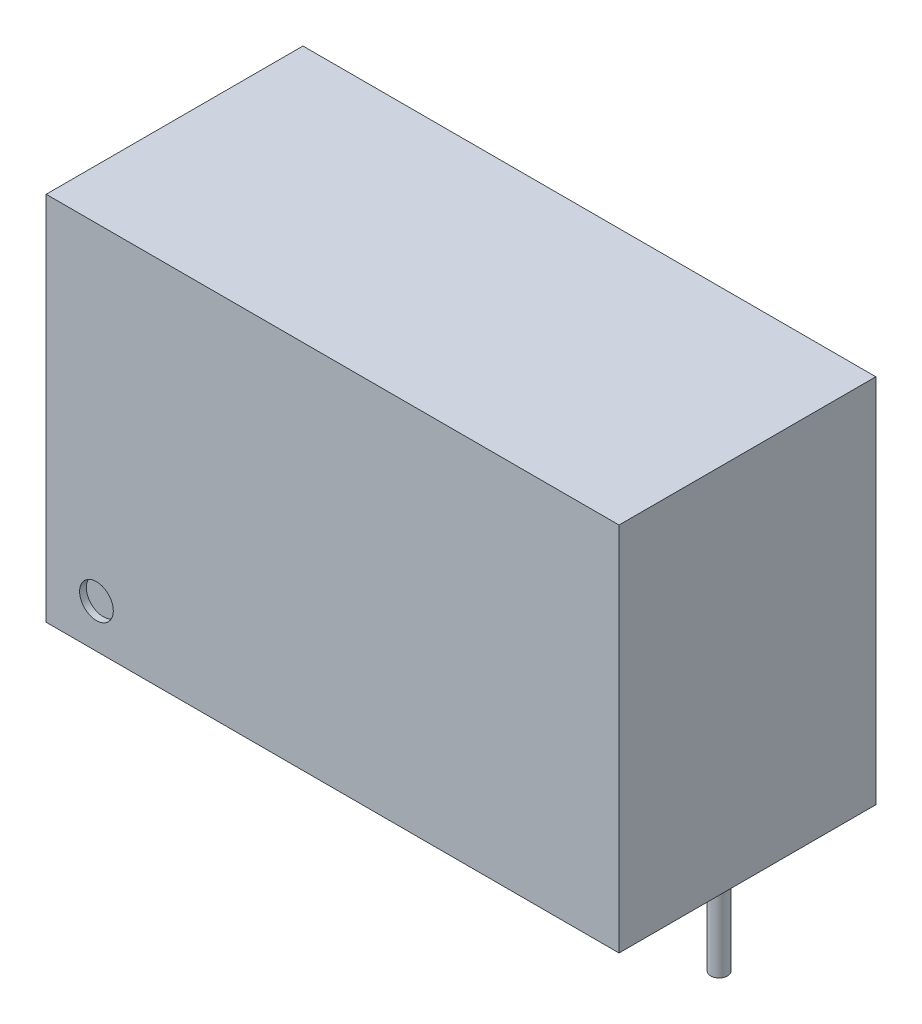
ISO-10303-21;
HEADER;
FILE_DESCRIPTION(('STEP AP214'),'2;1');
FILE_NAME('part.step','',(''),(''),'','','');
FILE_SCHEMA(('AUTOMOTIVE_DESIGN { 1 0 10303 214 1 1 1 1 }'));
ENDSEC;
DATA;
#1=APPLICATION_CONTEXT('core data for automotive mechanical design processes');
#2=APPLICATION_PROTOCOL_DEFINITION('international standard','automotive_design',2000,#1);
#3=PRODUCT_CONTEXT('',#1,'mechanical');
#4=PRODUCT('Part','Part','',(#3));
#5=PRODUCT_RELATED_PRODUCT_CATEGORY('part','',(#4));
#6=PRODUCT_DEFINITION_FORMATION('','',#4);
#7=PRODUCT_DEFINITION_CONTEXT('part definition',#1,'design');
#8=PRODUCT_DEFINITION('design','',#6,#7);
#9=PRODUCT_DEFINITION_SHAPE('','',#8);
#10=(LENGTH_UNIT() NAMED_UNIT(*) SI_UNIT(.MILLI.,.METRE.));
#11=(NAMED_UNIT(*) PLANE_ANGLE_UNIT() SI_UNIT($,.RADIAN.));
#12=(NAMED_UNIT(*) SI_UNIT($,.STERADIAN.) SOLID_ANGLE_UNIT());
#13=UNCERTAINTY_MEASURE_WITH_UNIT(LENGTH_MEASURE(1.E-05),#10,'distance_accuracy_value','');
#14=(GEOMETRIC_REPRESENTATION_CONTEXT(3) GLOBAL_UNCERTAINTY_ASSIGNED_CONTEXT((#13)) GLOBAL_UNIT_ASSIGNED_CONTEXT((#10,
#11,#12)) REPRESENTATION_CONTEXT('',''));
#15=CARTESIAN_POINT('',(0.,0.,0.));
#16=DIRECTION('',(0.,0.,1.));
#17=DIRECTION('',(1.,0.,0.));
#18=AXIS2_PLACEMENT_3D('',#15,#16,#17);
#19=CARTESIAN_POINT('',(14.85,-4.1,-5.12));
#20=DIRECTION('',(0.,1.,0.));
#21=DIRECTION('',(0.,0.,1.));
#22=AXIS2_PLACEMENT_3D('',#19,#20,#21);
#23=CYLINDRICAL_SURFACE('',#22,0.25);
#24=CARTESIAN_POINT('',(14.85,-4.1,-5.12));
#25=DIRECTION('',(0.,-1.,0.));
#26=DIRECTION('',(0.,0.,-1.));
#27=AXIS2_PLACEMENT_3D('',#24,#25,#26);
#28=CIRCLE('',#27,0.25);
#29=CARTESIAN_POINT('',(14.85,-4.1,-5.37));
#30=VERTEX_POINT('',#29);
#31=EDGE_CURVE('E11',#30,#30,#28,.T.);
#32=ORIENTED_EDGE('',*,*,#31,.F.);
#33=EDGE_LOOP('',(#32));
#34=FACE_BOUND('',#33,.T.);
#35=CARTESIAN_POINT('',(14.85,0.,-5.12));
#36=DIRECTION('',(0.,-1.,0.));
#37=DIRECTION('',(0.,0.,-1.));
#38=AXIS2_PLACEMENT_3D('',#35,#36,#37);
#39=CIRCLE('',#38,0.25);
#40=CARTESIAN_POINT('',(14.85,0.,-5.37));
#41=VERTEX_POINT('',#40);
#42=EDGE_CURVE('E44',#41,#41,#39,.T.);
#43=ORIENTED_EDGE('',*,*,#42,.T.);
#44=EDGE_LOOP('',(#43));
#45=FACE_BOUND('',#44,.T.);
#46=ADVANCED_FACE('F41',(#34,#45),#23,.T.);
#47=CARTESIAN_POINT('',(14.85,-4.1,-5.12));
#48=DIRECTION('',(0.,-1.,0.));
#49=DIRECTION('',(0.,0.,-1.));
#50=AXIS2_PLACEMENT_3D('',#47,#48,#49);
#51=PLANE('',#50);
#52=ORIENTED_EDGE('',*,*,#31,.T.);
#53=EDGE_LOOP('',(#52));
#54=FACE_BOUND('',#53,.T.);
#55=ADVANCED_FACE('F56',(#54),#51,.T.);
#56=CARTESIAN_POINT('',(14.85,0.,-5.12));
#57=DIRECTION('',(0.,-1.,0.));
#58=DIRECTION('',(0.,0.,-1.));
#59=AXIS2_PLACEMENT_3D('',#56,#57,#58);
#60=PLANE('',#59);
#61=ORIENTED_EDGE('',*,*,#42,.F.);
#62=EDGE_LOOP('',(#61));
#63=FACE_BOUND('',#62,.T.);
#64=ADVANCED_FACE('F54',(#63),#60,.F.);
#65=CLOSED_SHELL('',(#46,#55,#64));
#66=MANIFOLD_SOLID_BREP('B2',#65);
#67=CARTESIAN_POINT('',(12.31,-4.1,-5.12));
#68=DIRECTION('',(0.,1.,0.));
#69=DIRECTION('',(0.,0.,1.));
#70=AXIS2_PLACEMENT_3D('',#67,#68,#69);
#71=CYLINDRICAL_SURFACE('',#70,0.25);
#72=CARTESIAN_POINT('',(12.31,-4.1,-5.12));
#73=DIRECTION('',(0.,-1.,0.));
#74=DIRECTION('',(0.,0.,-1.));
#75=AXIS2_PLACEMENT_3D('',#72,#73,#74);
#76=CIRCLE('',#75,0.25);
#77=CARTESIAN_POINT('',(12.31,-4.1,-5.37));
#78=VERTEX_POINT('',#77);
#79=EDGE_CURVE('E40',#78,#78,#76,.T.);
#80=ORIENTED_EDGE('',*,*,#79,.F.);
#81=EDGE_LOOP('',(#80));
#82=FACE_BOUND('',#81,.T.);
#83=CARTESIAN_POINT('',(12.31,0.,-5.12));
#84=DIRECTION('',(0.,-1.,0.));
#85=DIRECTION('',(0.,0.,-1.));
#86=AXIS2_PLACEMENT_3D('',#83,#84,#85);
#87=CIRCLE('',#86,0.25);
#88=CARTESIAN_POINT('',(12.31,0.,-5.37));
#89=VERTEX_POINT('',#88);
#90=EDGE_CURVE('E92',#89,#89,#87,.T.);
#91=ORIENTED_EDGE('',*,*,#90,.T.);
#92=EDGE_LOOP('',(#91));
#93=FACE_BOUND('',#92,.T.);
#94=ADVANCED_FACE('F89',(#82,#93),#71,.T.);
#95=CARTESIAN_POINT('',(12.31,-4.1,-5.12));
#96=DIRECTION('',(0.,-1.,0.));
#97=DIRECTION('',(0.,0.,-1.));
#98=AXIS2_PLACEMENT_3D('',#95,#96,#97);
#99=PLANE('',#98);
#100=ORIENTED_EDGE('',*,*,#79,.T.);
#101=EDGE_LOOP('',(#100));
#102=FACE_BOUND('',#101,.T.);
#103=ADVANCED_FACE('F104',(#102),#99,.T.);
#104=CARTESIAN_POINT('',(12.31,0.,-5.12));
#105=DIRECTION('',(0.,-1.,0.));
#106=DIRECTION('',(0.,0.,-1.));
#107=AXIS2_PLACEMENT_3D('',#104,#105,#106);
#108=PLANE('',#107);
#109=ORIENTED_EDGE('',*,*,#90,.F.);
#110=EDGE_LOOP('',(#109));
#111=FACE_BOUND('',#110,.T.);
#112=ADVANCED_FACE('F102',(#111),#108,.F.);
#113=CLOSED_SHELL('',(#94,#103,#112));
#114=MANIFOLD_SOLID_BREP('B6',#113);
#115=CARTESIAN_POINT('',(9.77,-4.1,-5.12));
#116=DIRECTION('',(0.,1.,0.));
#117=DIRECTION('',(0.,0.,1.));
#118=AXIS2_PLACEMENT_3D('',#115,#116,#117);
#119=CYLINDRICAL_SURFACE('',#118,0.25);
#120=CARTESIAN_POINT('',(9.77,-4.1,-5.12));
#121=DIRECTION('',(0.,-1.,0.));
#122=DIRECTION('',(0.,0.,-1.));
#123=AXIS2_PLACEMENT_3D('',#120,#121,#122);
#124=CIRCLE('',#123,0.25);
#125=CARTESIAN_POINT('',(9.77,-4.1,-5.37));
#126=VERTEX_POINT('',#125);
#127=EDGE_CURVE('E88',#126,#126,#124,.T.);
#128=ORIENTED_EDGE('',*,*,#127,.F.);
#129=EDGE_LOOP('',(#128));
#130=FACE_BOUND('',#129,.T.);
#131=CARTESIAN_POINT('',(9.77,0.,-5.12));
#132=DIRECTION('',(0.,-1.,0.));
#133=DIRECTION('',(0.,0.,-1.));
#134=AXIS2_PLACEMENT_3D('',#131,#132,#133);
#135=CIRCLE('',#134,0.25);
#136=CARTESIAN_POINT('',(9.77,0.,-5.37));
#137=VERTEX_POINT('',#136);
#138=EDGE_CURVE('E140',#137,#137,#135,.T.);
#139=ORIENTED_EDGE('',*,*,#138,.T.);
#140=EDGE_LOOP('',(#139));
#141=FACE_BOUND('',#140,.T.);
#142=ADVANCED_FACE('F137',(#130,#141),#119,.T.);
#143=CARTESIAN_POINT('',(9.77,-4.1,-5.12));
#144=DIRECTION('',(0.,-1.,0.));
#145=DIRECTION('',(0.,0.,-1.));
#146=AXIS2_PLACEMENT_3D('',#143,#144,#145);
#147=PLANE('',#146);
#148=ORIENTED_EDGE('',*,*,#127,.T.);
#149=EDGE_LOOP('',(#148));
#150=FACE_BOUND('',#149,.T.);
#151=ADVANCED_FACE('F152',(#150),#147,.T.);
#152=CARTESIAN_POINT('',(9.77,0.,-5.12));
#153=DIRECTION('',(0.,-1.,0.));
#154=DIRECTION('',(0.,0.,-1.));
#155=AXIS2_PLACEMENT_3D('',#152,#153,#154);
#156=PLANE('',#155);
#157=ORIENTED_EDGE('',*,*,#138,.F.);
#158=EDGE_LOOP('',(#157));
#159=FACE_BOUND('',#158,.T.);
#160=ADVANCED_FACE('F150',(#159),#156,.F.);
#161=CLOSED_SHELL('',(#142,#151,#160));
#162=MANIFOLD_SOLID_BREP('B35',#161);
#163=CARTESIAN_POINT('',(4.69,-4.1,-5.12));
#164=DIRECTION('',(0.,1.,0.));
#165=DIRECTION('',(0.,0.,1.));
#166=AXIS2_PLACEMENT_3D('',#163,#164,#165);
#167=CYLINDRICAL_SURFACE('',#166,0.25);
#168=CARTESIAN_POINT('',(4.69,-4.1,-5.12));
#169=DIRECTION('',(0.,-1.,0.));
#170=DIRECTION('',(0.,0.,-1.));
#171=AXIS2_PLACEMENT_3D('',#168,#169,#170);
#172=CIRCLE('',#171,0.25);
#173=CARTESIAN_POINT('',(4.69,-4.1,-5.37));
#174=VERTEX_POINT('',#173);
#175=EDGE_CURVE('E136',#174,#174,#172,.T.);
#176=ORIENTED_EDGE('',*,*,#175,.F.);
#177=EDGE_LOOP('',(#176));
#178=FACE_BOUND('',#177,.T.);
#179=CARTESIAN_POINT('',(4.69,0.,-5.12));
#180=DIRECTION('',(0.,-1.,0.));
#181=DIRECTION('',(0.,0.,-1.));
#182=AXIS2_PLACEMENT_3D('',#179,#180,#181);
#183=CIRCLE('',#182,0.25);
#184=CARTESIAN_POINT('',(4.69,0.,-5.37));
#185=VERTEX_POINT('',#184);
#186=EDGE_CURVE('E188',#185,#185,#183,.T.);
#187=ORIENTED_EDGE('',*,*,#186,.T.);
#188=EDGE_LOOP('',(#187));
#189=FACE_BOUND('',#188,.T.);
#190=ADVANCED_FACE('F185',(#178,#189),#167,.T.);
#191=CARTESIAN_POINT('',(4.69,-4.1,-5.12));
#192=DIRECTION('',(0.,-1.,0.));
#193=DIRECTION('',(0.,0.,-1.));
#194=AXIS2_PLACEMENT_3D('',#191,#192,#193);
#195=PLANE('',#194);
#196=ORIENTED_EDGE('',*,*,#175,.T.);
#197=EDGE_LOOP('',(#196));
#198=FACE_BOUND('',#197,.T.);
#199=ADVANCED_FACE('F200',(#198),#195,.T.);
#200=CARTESIAN_POINT('',(4.69,0.,-5.12));
#201=DIRECTION('',(0.,-1.,0.));
#202=DIRECTION('',(0.,0.,-1.));
#203=AXIS2_PLACEMENT_3D('',#200,#201,#202);
#204=PLANE('',#203);
#205=ORIENTED_EDGE('',*,*,#186,.F.);
#206=EDGE_LOOP('',(#205));
#207=FACE_BOUND('',#206,.T.);
#208=ADVANCED_FACE('F198',(#207),#204,.F.);
#209=CLOSED_SHELL('',(#190,#199,#208));
#210=MANIFOLD_SOLID_BREP('B83',#209);
#211=CARTESIAN_POINT('',(2.15,-4.1,-5.12));
#212=DIRECTION('',(0.,1.,0.));
#213=DIRECTION('',(0.,0.,1.));
#214=AXIS2_PLACEMENT_3D('',#211,#212,#213);
#215=CYLINDRICAL_SURFACE('',#214,0.250000000000001);
#216=CARTESIAN_POINT('',(2.15,-4.1,-5.12));
#217=DIRECTION('',(0.,-1.,0.));
#218=DIRECTION('',(0.,0.,-1.));
#219=AXIS2_PLACEMENT_3D('',#216,#217,#218);
#220=CIRCLE('',#219,0.250000000000001);
#221=CARTESIAN_POINT('',(2.15,-4.1,-5.37));
#222=VERTEX_POINT('',#221);
#223=EDGE_CURVE('E184',#222,#222,#220,.T.);
#224=ORIENTED_EDGE('',*,*,#223,.F.);
#225=EDGE_LOOP('',(#224));
#226=FACE_BOUND('',#225,.T.);
#227=CARTESIAN_POINT('',(2.15,0.,-5.12));
#228=DIRECTION('',(0.,-1.,0.));
#229=DIRECTION('',(0.,0.,-1.));
#230=AXIS2_PLACEMENT_3D('',#227,#228,#229);
#231=CIRCLE('',#230,0.250000000000001);
#232=CARTESIAN_POINT('',(2.15,0.,-5.37));
#233=VERTEX_POINT('',#232);
#234=EDGE_CURVE('E237',#233,#233,#231,.T.);
#235=ORIENTED_EDGE('',*,*,#234,.T.);
#236=EDGE_LOOP('',(#235));
#237=FACE_BOUND('',#236,.T.);
#238=ADVANCED_FACE('F234',(#226,#237),#215,.T.);
#239=CARTESIAN_POINT('',(2.15,-4.1,-5.12));
#240=DIRECTION('',(0.,-1.,0.));
#241=DIRECTION('',(0.,0.,-1.));
#242=AXIS2_PLACEMENT_3D('',#239,#240,#241);
#243=PLANE('',#242);
#244=ORIENTED_EDGE('',*,*,#223,.T.);
#245=EDGE_LOOP('',(#244));
#246=FACE_BOUND('',#245,.T.);
#247=ADVANCED_FACE('F249',(#246),#243,.T.);
#248=CARTESIAN_POINT('',(2.15,0.,-5.12));
#249=DIRECTION('',(0.,-1.,0.));
#250=DIRECTION('',(0.,0.,-1.));
#251=AXIS2_PLACEMENT_3D('',#248,#249,#250);
#252=PLANE('',#251);
#253=ORIENTED_EDGE('',*,*,#234,.F.);
#254=EDGE_LOOP('',(#253));
#255=FACE_BOUND('',#254,.T.);
#256=ADVANCED_FACE('F247',(#255),#252,.F.);
#257=CLOSED_SHELL('',(#238,#247,#256));
#258=MANIFOLD_SOLID_BREP('B131',#257);
#259=CARTESIAN_POINT('',(0.,11.,0.));
#260=DIRECTION('',(1.,0.,0.));
#261=DIRECTION('',(0.,0.,-1.));
#262=AXIS2_PLACEMENT_3D('',#259,#260,#261);
#263=PLANE('',#262);
#264=DIRECTION('',(0.,0.,1.));
#265=VECTOR('',#264,1.);
#266=CARTESIAN_POINT('',(0.,0.,0.));
#267=LINE('',#266,#265);
#268=CARTESIAN_POINT('',(0.,0.,-7.62));
#269=VERTEX_POINT('',#268);
#270=CARTESIAN_POINT('',(0.,0.,0.));
#271=VERTEX_POINT('',#270);
#272=EDGE_CURVE('E337',#269,#271,#267,.T.);
#273=ORIENTED_EDGE('',*,*,#272,.T.);
#274=DIRECTION('',(0.,-1.,0.));
#275=VECTOR('',#274,1.);
#276=CARTESIAN_POINT('',(0.,11.,0.));
#277=LINE('',#276,#275);
#278=CARTESIAN_POINT('',(0.,11.,0.));
#279=VERTEX_POINT('',#278);
#280=EDGE_CURVE('E232',#279,#271,#277,.T.);
#281=ORIENTED_EDGE('',*,*,#280,.F.);
#282=DIRECTION('',(0.,0.,1.));
#283=VECTOR('',#282,1.);
#284=CARTESIAN_POINT('',(0.,11.,0.));
#285=LINE('',#284,#283);
#286=CARTESIAN_POINT('',(0.,11.,-7.62));
#287=VERTEX_POINT('',#286);
#288=EDGE_CURVE('E325',#287,#279,#285,.T.);
#289=ORIENTED_EDGE('',*,*,#288,.F.);
#290=DIRECTION('',(0.,-1.,0.));
#291=VECTOR('',#290,1.);
#292=CARTESIAN_POINT('',(0.,11.,-7.62));
#293=LINE('',#292,#291);
#294=EDGE_CURVE('E333',#287,#269,#293,.T.);
#295=ORIENTED_EDGE('',*,*,#294,.T.);
#296=EDGE_LOOP('',(#273,#281,#289,#295));
#297=FACE_BOUND('',#296,.T.);
#298=ADVANCED_FACE('F274',(#297),#263,.F.);
#299=CARTESIAN_POINT('',(0.,11.,0.));
#300=DIRECTION('',(0.,0.,-1.));
#301=DIRECTION('',(-1.,0.,0.));
#302=AXIS2_PLACEMENT_3D('',#299,#300,#301);
#303=PLANE('',#302);
#304=CARTESIAN_POINT('',(1.4920271093333,1.289577557197,0.));
#305=DIRECTION('',(0.,0.,1.));
#306=DIRECTION('',(1.,0.,0.));
#307=AXIS2_PLACEMENT_3D('',#304,#305,#306);
#308=CIRCLE('',#307,0.5);
#309=CARTESIAN_POINT('',(1.9920271093333,1.289577557197,0.));
#310=VERTEX_POINT('',#309);
#311=EDGE_CURVE('E351',#310,#310,#308,.T.);
#312=ORIENTED_EDGE('',*,*,#311,.F.);
#313=EDGE_LOOP('',(#312));
#314=FACE_BOUND('',#313,.T.);
#315=DIRECTION('',(1.,0.,0.));
#316=VECTOR('',#315,1.);
#317=CARTESIAN_POINT('',(0.,0.,0.));
#318=LINE('',#317,#316);
#319=CARTESIAN_POINT('',(17.,0.,0.));
#320=VERTEX_POINT('',#319);
#321=EDGE_CURVE('E329',#271,#320,#318,.T.);
#322=ORIENTED_EDGE('',*,*,#321,.T.);
#323=DIRECTION('',(0.,-1.,0.));
#324=VECTOR('',#323,1.);
#325=CARTESIAN_POINT('',(17.,11.,0.));
#326=LINE('',#325,#324);
#327=CARTESIAN_POINT('',(17.,11.,0.));
#328=VERTEX_POINT('',#327);
#329=EDGE_CURVE('E282',#328,#320,#326,.T.);
#330=ORIENTED_EDGE('',*,*,#329,.F.);
#331=DIRECTION('',(1.,0.,0.));
#332=VECTOR('',#331,1.);
#333=CARTESIAN_POINT('',(0.,11.,0.));
#334=LINE('',#333,#332);
#335=EDGE_CURVE('E320',#279,#328,#334,.T.);
#336=ORIENTED_EDGE('',*,*,#335,.F.);
#337=ORIENTED_EDGE('',*,*,#280,.T.);
#338=EDGE_LOOP('',(#322,#330,#336,#337));
#339=FACE_BOUND('',#338,.T.);
#340=ADVANCED_FACE('F328',(#314,#339),#303,.F.);
#341=CARTESIAN_POINT('',(17.,11.,0.));
#342=DIRECTION('',(-1.,0.,0.));
#343=DIRECTION('',(0.,0.,1.));
#344=AXIS2_PLACEMENT_3D('',#341,#342,#343);
#345=PLANE('',#344);
#346=DIRECTION('',(0.,0.,-1.));
#347=VECTOR('',#346,1.);
#348=CARTESIAN_POINT('',(17.,0.,0.));
#349=LINE('',#348,#347);
#350=CARTESIAN_POINT('',(17.,0.,-7.62));
#351=VERTEX_POINT('',#350);
#352=EDGE_CURVE('E307',#320,#351,#349,.T.);
#353=ORIENTED_EDGE('',*,*,#352,.T.);
#354=DIRECTION('',(0.,-1.,0.));
#355=VECTOR('',#354,1.);
#356=CARTESIAN_POINT('',(17.,11.,-7.62));
#357=LINE('',#356,#355);
#358=CARTESIAN_POINT('',(17.,11.,-7.62));
#359=VERTEX_POINT('',#358);
#360=EDGE_CURVE('E330',#359,#351,#357,.T.);
#361=ORIENTED_EDGE('',*,*,#360,.F.);
#362=DIRECTION('',(0.,0.,-1.));
#363=VECTOR('',#362,1.);
#364=CARTESIAN_POINT('',(17.,11.,0.));
#365=LINE('',#364,#363);
#366=EDGE_CURVE('E323',#328,#359,#365,.T.);
#367=ORIENTED_EDGE('',*,*,#366,.F.);
#368=ORIENTED_EDGE('',*,*,#329,.T.);
#369=EDGE_LOOP('',(#353,#361,#367,#368));
#370=FACE_BOUND('',#369,.T.);
#371=ADVANCED_FACE('F331',(#370),#345,.F.);
#372=CARTESIAN_POINT('',(0.,11.,-7.62));
#373=DIRECTION('',(0.,0.,1.));
#374=DIRECTION('',(1.,0.,0.));
#375=AXIS2_PLACEMENT_3D('',#372,#373,#374);
#376=PLANE('',#375);
#377=DIRECTION('',(-1.,0.,0.));
#378=VECTOR('',#377,1.);
#379=CARTESIAN_POINT('',(0.,0.,-7.62));
#380=LINE('',#379,#378);
#381=EDGE_CURVE('E313',#351,#269,#380,.T.);
#382=ORIENTED_EDGE('',*,*,#381,.T.);
#383=ORIENTED_EDGE('',*,*,#294,.F.);
#384=DIRECTION('',(-1.,0.,0.));
#385=VECTOR('',#384,1.);
#386=CARTESIAN_POINT('',(0.,11.,-7.62));
#387=LINE('',#386,#385);
#388=EDGE_CURVE('E290',#359,#287,#387,.T.);
#389=ORIENTED_EDGE('',*,*,#388,.F.);
#390=ORIENTED_EDGE('',*,*,#360,.T.);
#391=EDGE_LOOP('',(#382,#383,#389,#390));
#392=FACE_BOUND('',#391,.T.);
#393=ADVANCED_FACE('F345',(#392),#376,.F.);
#394=CARTESIAN_POINT('',(0.,11.,0.));
#395=DIRECTION('',(0.,-1.,0.));
#396=DIRECTION('',(0.,0.,-1.));
#397=AXIS2_PLACEMENT_3D('',#394,#395,#396);
#398=PLANE('',#397);
#399=ORIENTED_EDGE('',*,*,#288,.T.);
#400=ORIENTED_EDGE('',*,*,#335,.T.);
#401=ORIENTED_EDGE('',*,*,#366,.T.);
#402=ORIENTED_EDGE('',*,*,#388,.T.);
#403=EDGE_LOOP('',(#399,#400,#401,#402));
#404=FACE_BOUND('',#403,.T.);
#405=ADVANCED_FACE('F321',(#404),#398,.F.);
#406=CARTESIAN_POINT('',(0.,0.,0.));
#407=DIRECTION('',(0.,-1.,0.));
#408=DIRECTION('',(0.,0.,-1.));
#409=AXIS2_PLACEMENT_3D('',#406,#407,#408);
#410=PLANE('',#409);
#411=ORIENTED_EDGE('',*,*,#272,.F.);
#412=ORIENTED_EDGE('',*,*,#381,.F.);
#413=ORIENTED_EDGE('',*,*,#352,.F.);
#414=ORIENTED_EDGE('',*,*,#321,.F.);
#415=EDGE_LOOP('',(#411,#412,#413,#414));
#416=FACE_BOUND('',#415,.T.);
#417=ADVANCED_FACE('F348',(#416),#410,.T.);
#418=CARTESIAN_POINT('',(1.4920271093333,1.289577557197,-0.2));
#419=DIRECTION('',(0.,0.,1.));
#420=DIRECTION('',(1.,0.,0.));
#421=AXIS2_PLACEMENT_3D('',#418,#419,#420);
#422=CYLINDRICAL_SURFACE('',#421,0.5);
#423=CARTESIAN_POINT('',(1.4920271093333,1.289577557197,-0.2));
#424=DIRECTION('',(0.,0.,1.));
#425=DIRECTION('',(1.,0.,0.));
#426=AXIS2_PLACEMENT_3D('',#423,#424,#425);
#427=CIRCLE('',#426,0.5);
#428=CARTESIAN_POINT('',(1.9920271093333,1.289577557197,-0.2));
#429=VERTEX_POINT('',#428);
#430=EDGE_CURVE('E340',#429,#429,#427,.T.);
#431=ORIENTED_EDGE('',*,*,#430,.F.);
#432=EDGE_LOOP('',(#431));
#433=FACE_BOUND('',#432,.T.);
#434=ORIENTED_EDGE('',*,*,#311,.T.);
#435=EDGE_LOOP('',(#434));
#436=FACE_BOUND('',#435,.T.);
#437=ADVANCED_FACE('F359',(#433,#436),#422,.F.);
#438=CARTESIAN_POINT('',(1.4920271093333,1.289577557197,-0.2));
#439=DIRECTION('',(0.,0.,1.));
#440=DIRECTION('',(1.,0.,0.));
#441=AXIS2_PLACEMENT_3D('',#438,#439,#440);
#442=PLANE('',#441);
#443=ORIENTED_EDGE('',*,*,#430,.T.);
#444=EDGE_LOOP('',(#443));
#445=FACE_BOUND('',#444,.T.);
#446=ADVANCED_FACE('F357',(#445),#442,.T.);
#447=CLOSED_SHELL('',(#298,#340,#371,#393,#405,#417,#437,#446));
#448=MANIFOLD_SOLID_BREP('B179',#447);
#449=ADVANCED_BREP_SHAPE_REPRESENTATION('',(#18,#66,#114,#162,#210,#258,#448),#14);
#450=SHAPE_DEFINITION_REPRESENTATION(#9,#449);
ENDSEC;
END-ISO-10303-21;
